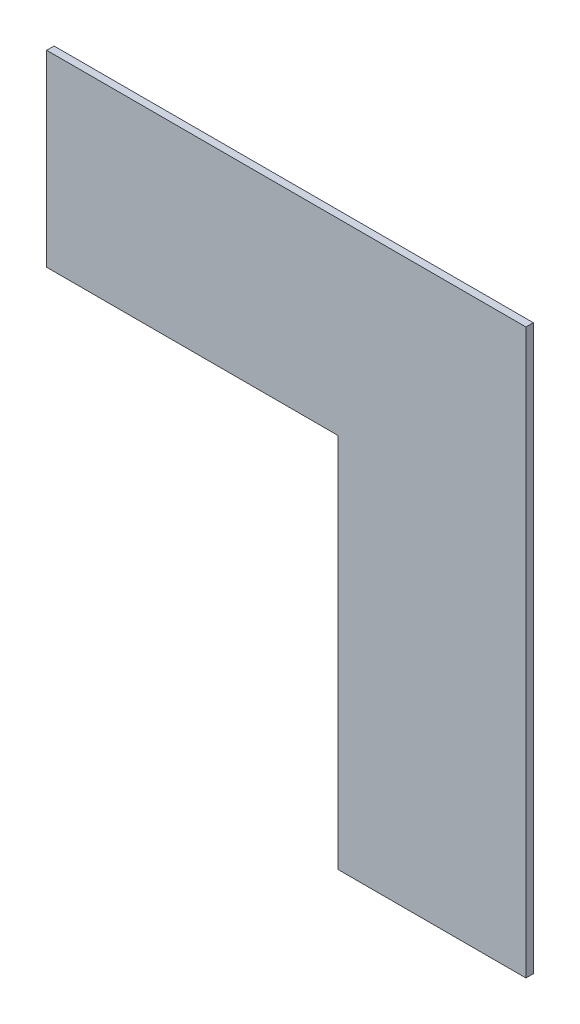
ISO-10303-21;
HEADER;
FILE_DESCRIPTION(('STEP AP214'),'2;1');
FILE_NAME('part.step','',(''),(''),'','','');
FILE_SCHEMA(('AUTOMOTIVE_DESIGN { 1 0 10303 214 1 1 1 1 }'));
ENDSEC;
DATA;
#1=APPLICATION_CONTEXT('core data for automotive mechanical design processes');
#2=APPLICATION_PROTOCOL_DEFINITION('international standard','automotive_design',2000,#1);
#3=PRODUCT_CONTEXT('',#1,'mechanical');
#4=PRODUCT('Part','Part','',(#3));
#5=PRODUCT_RELATED_PRODUCT_CATEGORY('part','',(#4));
#6=PRODUCT_DEFINITION_FORMATION('','',#4);
#7=PRODUCT_DEFINITION_CONTEXT('part definition',#1,'design');
#8=PRODUCT_DEFINITION('design','',#6,#7);
#9=PRODUCT_DEFINITION_SHAPE('','',#8);
#10=(LENGTH_UNIT() NAMED_UNIT(*) SI_UNIT(.MILLI.,.METRE.));
#11=(NAMED_UNIT(*) PLANE_ANGLE_UNIT() SI_UNIT($,.RADIAN.));
#12=(NAMED_UNIT(*) SI_UNIT($,.STERADIAN.) SOLID_ANGLE_UNIT());
#13=UNCERTAINTY_MEASURE_WITH_UNIT(LENGTH_MEASURE(1.E-05),#10,'distance_accuracy_value','');
#14=(GEOMETRIC_REPRESENTATION_CONTEXT(3) GLOBAL_UNCERTAINTY_ASSIGNED_CONTEXT((#13)) GLOBAL_UNIT_ASSIGNED_CONTEXT((#10,
#11,#12)) REPRESENTATION_CONTEXT('',''));
#15=CARTESIAN_POINT('',(0.,0.,0.));
#16=DIRECTION('',(0.,0.,1.));
#17=DIRECTION('',(1.,0.,0.));
#18=AXIS2_PLACEMENT_3D('',#15,#16,#17);
#19=CARTESIAN_POINT('',(-0.32385,0.381,0.));
#20=DIRECTION('',(0.,0.,1.));
#21=DIRECTION('',(1.,0.,0.));
#22=AXIS2_PLACEMENT_3D('',#19,#20,#21);
#23=PLANE('',#22);
#24=DIRECTION('',(1.,0.,0.));
#25=VECTOR('',#24,1.);
#26=CARTESIAN_POINT('',(0.32385,-0.381,0.));
#27=LINE('',#26,#25);
#28=CARTESIAN_POINT('',(0.06985,-0.381,0.));
#29=VERTEX_POINT('',#28);
#30=CARTESIAN_POINT('',(0.32385,-0.381,0.));
#31=VERTEX_POINT('',#30);
#32=EDGE_CURVE('E103',#29,#31,#27,.T.);
#33=ORIENTED_EDGE('',*,*,#32,.F.);
#34=DIRECTION('',(0.,1.,0.));
#35=VECTOR('',#34,1.);
#36=CARTESIAN_POINT('',(0.06985,-0.381,0.));
#37=LINE('',#36,#35);
#38=CARTESIAN_POINT('',(0.06985,0.127,0.));
#39=VERTEX_POINT('',#38);
#40=EDGE_CURVE('E100',#39,#29,#37,.F.);
#41=ORIENTED_EDGE('',*,*,#40,.F.);
#42=DIRECTION('',(1.,0.,0.));
#43=VECTOR('',#42,1.);
#44=CARTESIAN_POINT('',(0.06985,0.127,0.));
#45=LINE('',#44,#43);
#46=CARTESIAN_POINT('',(-0.32385,0.127,0.));
#47=VERTEX_POINT('',#46);
#48=EDGE_CURVE('E95',#47,#39,#45,.T.);
#49=ORIENTED_EDGE('',*,*,#48,.F.);
#50=DIRECTION('',(0.,1.,0.));
#51=VECTOR('',#50,1.);
#52=CARTESIAN_POINT('',(-0.32385,0.127,0.));
#53=LINE('',#52,#51);
#54=CARTESIAN_POINT('',(-0.32385,0.381,0.));
#55=VERTEX_POINT('',#54);
#56=EDGE_CURVE('E81',#55,#47,#53,.F.);
#57=ORIENTED_EDGE('',*,*,#56,.F.);
#58=DIRECTION('',(1.,0.,0.));
#59=VECTOR('',#58,1.);
#60=CARTESIAN_POINT('',(-0.32385,0.381,0.));
#61=LINE('',#60,#59);
#62=CARTESIAN_POINT('',(0.32385,0.381,0.));
#63=VERTEX_POINT('',#62);
#64=EDGE_CURVE('E67',#63,#55,#61,.F.);
#65=ORIENTED_EDGE('',*,*,#64,.F.);
#66=DIRECTION('',(0.,1.,0.));
#67=VECTOR('',#66,1.);
#68=CARTESIAN_POINT('',(0.32385,0.381,0.));
#69=LINE('',#68,#67);
#70=EDGE_CURVE('E20',#31,#63,#69,.T.);
#71=ORIENTED_EDGE('',*,*,#70,.F.);
#72=EDGE_LOOP('',(#33,#41,#49,#57,#65,#71));
#73=FACE_BOUND('',#72,.T.);
#74=ADVANCED_FACE('F17',(#73),#23,.F.);
#75=CARTESIAN_POINT('',(0.32385,0.381,0.));
#76=DIRECTION('',(1.,0.,0.));
#77=DIRECTION('',(0.,0.,-1.));
#78=AXIS2_PLACEMENT_3D('',#75,#76,#77);
#79=PLANE('',#78);
#80=DIRECTION('',(0.,0.,1.));
#81=VECTOR('',#80,1.);
#82=CARTESIAN_POINT('',(0.32385,0.381,0.));
#83=LINE('',#82,#81);
#84=CARTESIAN_POINT('',(0.32385,0.381,0.01));
#85=VERTEX_POINT('',#84);
#86=EDGE_CURVE('E73',#85,#63,#83,.F.);
#87=ORIENTED_EDGE('',*,*,#86,.F.);
#88=DIRECTION('',(0.,1.,0.));
#89=VECTOR('',#88,1.);
#90=CARTESIAN_POINT('',(0.32385,0.381,0.01));
#91=LINE('',#90,#89);
#92=CARTESIAN_POINT('',(0.32385,-0.381,0.01));
#93=VERTEX_POINT('',#92);
#94=EDGE_CURVE('E106',#93,#85,#91,.T.);
#95=ORIENTED_EDGE('',*,*,#94,.F.);
#96=DIRECTION('',(0.,0.,-1.));
#97=VECTOR('',#96,1.);
#98=CARTESIAN_POINT('',(0.32385,-0.381,0.));
#99=LINE('',#98,#97);
#100=EDGE_CURVE('E76',#31,#93,#99,.F.);
#101=ORIENTED_EDGE('',*,*,#100,.F.);
#102=ORIENTED_EDGE('',*,*,#70,.T.);
#103=EDGE_LOOP('',(#87,#95,#101,#102));
#104=FACE_BOUND('',#103,.T.);
#105=ADVANCED_FACE('F72',(#104),#79,.T.);
#106=CARTESIAN_POINT('',(-0.32385,0.381,0.));
#107=DIRECTION('',(0.,1.,0.));
#108=DIRECTION('',(0.,0.,1.));
#109=AXIS2_PLACEMENT_3D('',#106,#107,#108);
#110=PLANE('',#109);
#111=DIRECTION('',(0.,0.,1.));
#112=VECTOR('',#111,1.);
#113=CARTESIAN_POINT('',(-0.32385,0.381,0.));
#114=LINE('',#113,#112);
#115=CARTESIAN_POINT('',(-0.32385,0.381,0.01));
#116=VERTEX_POINT('',#115);
#117=EDGE_CURVE('E83',#116,#55,#114,.F.);
#118=ORIENTED_EDGE('',*,*,#117,.F.);
#119=DIRECTION('',(1.,0.,0.));
#120=VECTOR('',#119,1.);
#121=CARTESIAN_POINT('',(-0.32385,0.381,0.01));
#122=LINE('',#121,#120);
#123=EDGE_CURVE('E87',#85,#116,#122,.F.);
#124=ORIENTED_EDGE('',*,*,#123,.F.);
#125=ORIENTED_EDGE('',*,*,#86,.T.);
#126=ORIENTED_EDGE('',*,*,#64,.T.);
#127=EDGE_LOOP('',(#118,#124,#125,#126));
#128=FACE_BOUND('',#127,.T.);
#129=ADVANCED_FACE('F85',(#128),#110,.T.);
#130=CARTESIAN_POINT('',(-0.32385,0.127,0.));
#131=DIRECTION('',(-1.,0.,0.));
#132=DIRECTION('',(0.,0.,1.));
#133=AXIS2_PLACEMENT_3D('',#130,#131,#132);
#134=PLANE('',#133);
#135=DIRECTION('',(0.,0.,-1.));
#136=VECTOR('',#135,1.);
#137=CARTESIAN_POINT('',(-0.32385,0.127,0.));
#138=LINE('',#137,#136);
#139=CARTESIAN_POINT('',(-0.32385,0.127,0.01));
#140=VERTEX_POINT('',#139);
#141=EDGE_CURVE('E92',#140,#47,#138,.T.);
#142=ORIENTED_EDGE('',*,*,#141,.F.);
#143=DIRECTION('',(0.,1.,0.));
#144=VECTOR('',#143,1.);
#145=CARTESIAN_POINT('',(-0.32385,0.381,0.01));
#146=LINE('',#145,#144);
#147=EDGE_CURVE('E109',#116,#140,#146,.F.);
#148=ORIENTED_EDGE('',*,*,#147,.F.);
#149=ORIENTED_EDGE('',*,*,#117,.T.);
#150=ORIENTED_EDGE('',*,*,#56,.T.);
#151=EDGE_LOOP('',(#142,#148,#149,#150));
#152=FACE_BOUND('',#151,.T.);
#153=ADVANCED_FACE('F137',(#152),#134,.T.);
#154=CARTESIAN_POINT('',(0.06985,0.127,0.));
#155=DIRECTION('',(0.,-1.,0.));
#156=DIRECTION('',(0.,0.,-1.));
#157=AXIS2_PLACEMENT_3D('',#154,#155,#156);
#158=PLANE('',#157);
#159=DIRECTION('',(0.,0.,1.));
#160=VECTOR('',#159,1.);
#161=CARTESIAN_POINT('',(0.06985,0.127,0.));
#162=LINE('',#161,#160);
#163=CARTESIAN_POINT('',(0.06985,0.127,0.01));
#164=VERTEX_POINT('',#163);
#165=EDGE_CURVE('E97',#164,#39,#162,.F.);
#166=ORIENTED_EDGE('',*,*,#165,.F.);
#167=DIRECTION('',(1.,0.,0.));
#168=VECTOR('',#167,1.);
#169=CARTESIAN_POINT('',(-0.32385,0.127,0.01));
#170=LINE('',#169,#168);
#171=EDGE_CURVE('E112',#140,#164,#170,.T.);
#172=ORIENTED_EDGE('',*,*,#171,.F.);
#173=ORIENTED_EDGE('',*,*,#141,.T.);
#174=ORIENTED_EDGE('',*,*,#48,.T.);
#175=EDGE_LOOP('',(#166,#172,#173,#174));
#176=FACE_BOUND('',#175,.T.);
#177=ADVANCED_FACE('F122',(#176),#158,.T.);
#178=CARTESIAN_POINT('',(0.06985,-0.381,0.));
#179=DIRECTION('',(-1.,0.,0.));
#180=DIRECTION('',(0.,0.,1.));
#181=AXIS2_PLACEMENT_3D('',#178,#179,#180);
#182=PLANE('',#181);
#183=DIRECTION('',(0.,0.,-1.));
#184=VECTOR('',#183,1.);
#185=CARTESIAN_POINT('',(0.06985,-0.381,0.));
#186=LINE('',#185,#184);
#187=CARTESIAN_POINT('',(0.06985,-0.381,0.01));
#188=VERTEX_POINT('',#187);
#189=EDGE_CURVE('E35',#188,#29,#186,.T.);
#190=ORIENTED_EDGE('',*,*,#189,.F.);
#191=DIRECTION('',(0.,1.,0.));
#192=VECTOR('',#191,1.);
#193=CARTESIAN_POINT('',(0.06985,0.381,0.01));
#194=LINE('',#193,#192);
#195=EDGE_CURVE('E26',#164,#188,#194,.F.);
#196=ORIENTED_EDGE('',*,*,#195,.F.);
#197=ORIENTED_EDGE('',*,*,#165,.T.);
#198=ORIENTED_EDGE('',*,*,#40,.T.);
#199=EDGE_LOOP('',(#190,#196,#197,#198));
#200=FACE_BOUND('',#199,.T.);
#201=ADVANCED_FACE('F119',(#200),#182,.T.);
#202=CARTESIAN_POINT('',(0.32385,-0.381,0.));
#203=DIRECTION('',(0.,-1.,0.));
#204=DIRECTION('',(0.,0.,-1.));
#205=AXIS2_PLACEMENT_3D('',#202,#203,#204);
#206=PLANE('',#205);
#207=ORIENTED_EDGE('',*,*,#100,.T.);
#208=DIRECTION('',(1.,0.,0.));
#209=VECTOR('',#208,1.);
#210=CARTESIAN_POINT('',(-0.32385,-0.381,0.01));
#211=LINE('',#210,#209);
#212=EDGE_CURVE('E11',#188,#93,#211,.T.);
#213=ORIENTED_EDGE('',*,*,#212,.F.);
#214=ORIENTED_EDGE('',*,*,#189,.T.);
#215=ORIENTED_EDGE('',*,*,#32,.T.);
#216=EDGE_LOOP('',(#207,#213,#214,#215));
#217=FACE_BOUND('',#216,.T.);
#218=ADVANCED_FACE('F124',(#217),#206,.T.);
#219=CARTESIAN_POINT('',(-0.32385,0.381,0.01));
#220=DIRECTION('',(0.,0.,1.));
#221=DIRECTION('',(1.,0.,0.));
#222=AXIS2_PLACEMENT_3D('',#219,#220,#221);
#223=PLANE('',#222);
#224=ORIENTED_EDGE('',*,*,#195,.T.);
#225=ORIENTED_EDGE('',*,*,#212,.T.);
#226=ORIENTED_EDGE('',*,*,#94,.T.);
#227=ORIENTED_EDGE('',*,*,#123,.T.);
#228=ORIENTED_EDGE('',*,*,#147,.T.);
#229=ORIENTED_EDGE('',*,*,#171,.T.);
#230=EDGE_LOOP('',(#224,#225,#226,#227,#228,#229));
#231=FACE_BOUND('',#230,.T.);
#232=ADVANCED_FACE('F117',(#231),#223,.T.);
#233=CLOSED_SHELL('',(#74,#105,#129,#153,#177,#201,#218,#232));
#234=MANIFOLD_SOLID_BREP('B1',#233);
#235=ADVANCED_BREP_SHAPE_REPRESENTATION('',(#18,#234),#14);
#236=SHAPE_DEFINITION_REPRESENTATION(#9,#235);
ENDSEC;
END-ISO-10303-21;
